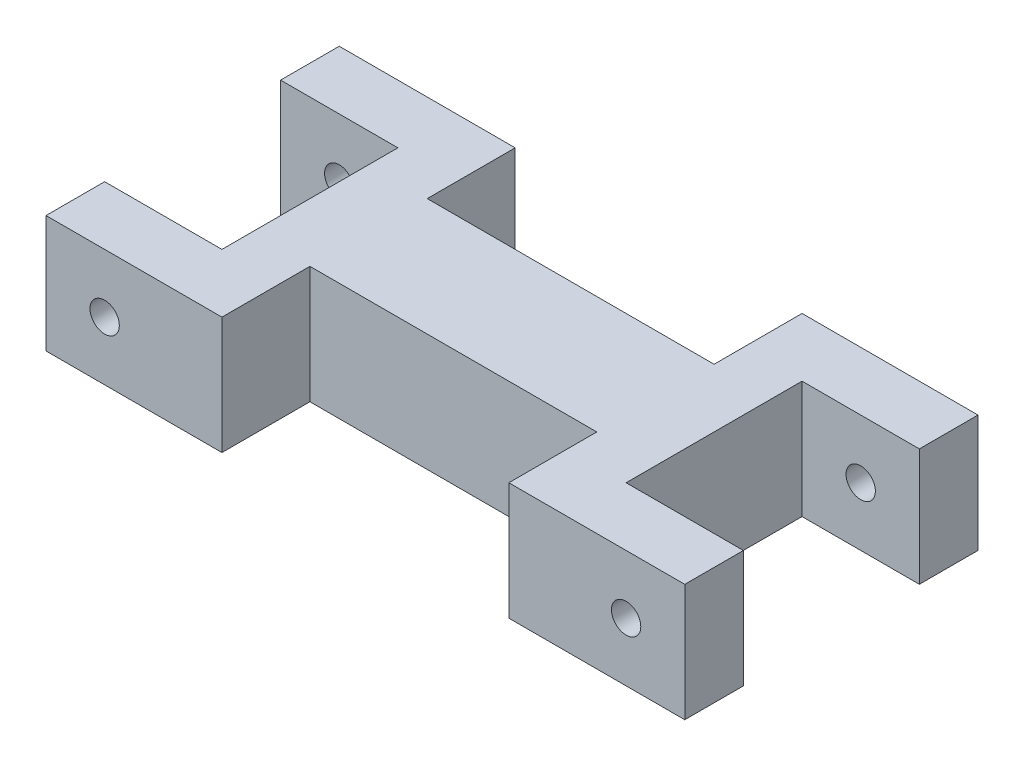
ISO-10303-21;
HEADER;
FILE_DESCRIPTION(('STEP AP214'),'2;1');
FILE_NAME('part.step','',(''),(''),'','','');
FILE_SCHEMA(('AUTOMOTIVE_DESIGN { 1 0 10303 214 1 1 1 1 }'));
ENDSEC;
DATA;
#1=APPLICATION_CONTEXT('core data for automotive mechanical design processes');
#2=APPLICATION_PROTOCOL_DEFINITION('international standard','automotive_design',2000,#1);
#3=PRODUCT_CONTEXT('',#1,'mechanical');
#4=PRODUCT('Part','Part','',(#3));
#5=PRODUCT_RELATED_PRODUCT_CATEGORY('part','',(#4));
#6=PRODUCT_DEFINITION_FORMATION('','',#4);
#7=PRODUCT_DEFINITION_CONTEXT('part definition',#1,'design');
#8=PRODUCT_DEFINITION('design','',#6,#7);
#9=PRODUCT_DEFINITION_SHAPE('','',#8);
#10=(LENGTH_UNIT() NAMED_UNIT(*) SI_UNIT(.MILLI.,.METRE.));
#11=(NAMED_UNIT(*) PLANE_ANGLE_UNIT() SI_UNIT($,.RADIAN.));
#12=(NAMED_UNIT(*) SI_UNIT($,.STERADIAN.) SOLID_ANGLE_UNIT());
#13=UNCERTAINTY_MEASURE_WITH_UNIT(LENGTH_MEASURE(1.E-05),#10,'distance_accuracy_value','');
#14=(GEOMETRIC_REPRESENTATION_CONTEXT(3) GLOBAL_UNCERTAINTY_ASSIGNED_CONTEXT((#13)) GLOBAL_UNIT_ASSIGNED_CONTEXT((#10,
#11,#12)) REPRESENTATION_CONTEXT('',''));
#15=CARTESIAN_POINT('',(0.,0.,0.));
#16=DIRECTION('',(0.,0.,1.));
#17=DIRECTION('',(1.,0.,0.));
#18=AXIS2_PLACEMENT_3D('',#15,#16,#17);
#19=CARTESIAN_POINT('',(0.,12.7,-9.525));
#20=DIRECTION('',(1.,0.,0.));
#21=DIRECTION('',(0.,0.,-1.));
#22=AXIS2_PLACEMENT_3D('',#19,#20,#21);
#23=PLANE('',#22);
#24=DIRECTION('',(0.,0.,1.));
#25=VECTOR('',#24,1.);
#26=CARTESIAN_POINT('',(0.,0.,-9.525));
#27=LINE('',#26,#25);
#28=CARTESIAN_POINT('',(0.,0.,-9.525));
#29=VERTEX_POINT('',#28);
#30=CARTESIAN_POINT('',(0.,0.,9.525));
#31=VERTEX_POINT('',#30);
#32=EDGE_CURVE('E201',#29,#31,#27,.T.);
#33=ORIENTED_EDGE('',*,*,#32,.T.);
#34=DIRECTION('',(0.,-1.,0.));
#35=VECTOR('',#34,1.);
#36=CARTESIAN_POINT('',(0.,12.7,9.525));
#37=LINE('',#36,#35);
#38=CARTESIAN_POINT('',(0.,12.7,9.525));
#39=VERTEX_POINT('',#38);
#40=EDGE_CURVE('E11',#39,#31,#37,.T.);
#41=ORIENTED_EDGE('',*,*,#40,.F.);
#42=DIRECTION('',(0.,0.,1.));
#43=VECTOR('',#42,1.);
#44=CARTESIAN_POINT('',(0.,12.7,-9.525));
#45=LINE('',#44,#43);
#46=CARTESIAN_POINT('',(0.,12.7,-9.525));
#47=VERTEX_POINT('',#46);
#48=EDGE_CURVE('E240',#47,#39,#45,.T.);
#49=ORIENTED_EDGE('',*,*,#48,.F.);
#50=DIRECTION('',(0.,-1.,0.));
#51=VECTOR('',#50,1.);
#52=CARTESIAN_POINT('',(0.,12.7,-9.525));
#53=LINE('',#52,#51);
#54=EDGE_CURVE('E197',#47,#29,#53,.T.);
#55=ORIENTED_EDGE('',*,*,#54,.T.);
#56=EDGE_LOOP('',(#33,#41,#49,#55));
#57=FACE_BOUND('',#56,.T.);
#58=ADVANCED_FACE('F32',(#57),#23,.F.);
#59=CARTESIAN_POINT('',(0.,12.7,9.525));
#60=DIRECTION('',(0.,0.,1.));
#61=DIRECTION('',(1.,0.,0.));
#62=AXIS2_PLACEMENT_3D('',#59,#60,#61);
#63=PLANE('',#62);
#64=CARTESIAN_POINT('',(-6.35,6.34999999999879,9.525));
#65=DIRECTION('',(0.,0.,1.));
#66=DIRECTION('',(1.,0.,0.));
#67=AXIS2_PLACEMENT_3D('',#64,#65,#66);
#68=CIRCLE('',#67,1.5875);
#69=CARTESIAN_POINT('',(-4.7625,6.34999999999879,9.525));
#70=VERTEX_POINT('',#69);
#71=EDGE_CURVE('E439',#70,#70,#68,.T.);
#72=ORIENTED_EDGE('',*,*,#71,.T.);
#73=EDGE_LOOP('',(#72));
#74=FACE_BOUND('',#73,.T.);
#75=DIRECTION('',(-1.,0.,0.));
#76=VECTOR('',#75,1.);
#77=CARTESIAN_POINT('',(0.,0.,9.525));
#78=LINE('',#77,#76);
#79=CARTESIAN_POINT('',(-12.7,0.,9.525));
#80=VERTEX_POINT('',#79);
#81=EDGE_CURVE('E204',#31,#80,#78,.T.);
#82=ORIENTED_EDGE('',*,*,#81,.T.);
#83=DIRECTION('',(0.,-1.,0.));
#84=VECTOR('',#83,1.);
#85=CARTESIAN_POINT('',(-12.7,12.7,9.525));
#86=LINE('',#85,#84);
#87=CARTESIAN_POINT('',(-12.7,12.7,9.525));
#88=VERTEX_POINT('',#87);
#89=EDGE_CURVE('E41',#88,#80,#86,.T.);
#90=ORIENTED_EDGE('',*,*,#89,.F.);
#91=DIRECTION('',(-1.,0.,0.));
#92=VECTOR('',#91,1.);
#93=CARTESIAN_POINT('',(0.,12.7,9.525));
#94=LINE('',#93,#92);
#95=EDGE_CURVE('E128',#39,#88,#94,.T.);
#96=ORIENTED_EDGE('',*,*,#95,.F.);
#97=ORIENTED_EDGE('',*,*,#40,.T.);
#98=EDGE_LOOP('',(#82,#90,#96,#97));
#99=FACE_BOUND('',#98,.T.);
#100=ADVANCED_FACE('F361',(#74,#99),#63,.F.);
#101=CARTESIAN_POINT('',(-12.7,12.7,9.525));
#102=DIRECTION('',(1.,0.,0.));
#103=DIRECTION('',(0.,0.,-1.));
#104=AXIS2_PLACEMENT_3D('',#101,#102,#103);
#105=PLANE('',#104);
#106=DIRECTION('',(0.,0.,1.));
#107=VECTOR('',#106,1.);
#108=CARTESIAN_POINT('',(-12.7,0.,9.525));
#109=LINE('',#108,#107);
#110=CARTESIAN_POINT('',(-12.7,0.,15.875));
#111=VERTEX_POINT('',#110);
#112=EDGE_CURVE('E207',#80,#111,#109,.T.);
#113=ORIENTED_EDGE('',*,*,#112,.T.);
#114=DIRECTION('',(0.,-1.,0.));
#115=VECTOR('',#114,1.);
#116=CARTESIAN_POINT('',(-12.7,12.7,15.875));
#117=LINE('',#116,#115);
#118=CARTESIAN_POINT('',(-12.7,12.7,15.875));
#119=VERTEX_POINT('',#118);
#120=EDGE_CURVE('E283',#119,#111,#117,.T.);
#121=ORIENTED_EDGE('',*,*,#120,.F.);
#122=DIRECTION('',(0.,0.,1.));
#123=VECTOR('',#122,1.);
#124=CARTESIAN_POINT('',(-12.7,12.7,9.525));
#125=LINE('',#124,#123);
#126=EDGE_CURVE('E292',#88,#119,#125,.T.);
#127=ORIENTED_EDGE('',*,*,#126,.F.);
#128=ORIENTED_EDGE('',*,*,#89,.T.);
#129=EDGE_LOOP('',(#113,#121,#127,#128));
#130=FACE_BOUND('',#129,.T.);
#131=ADVANCED_FACE('F290',(#130),#105,.F.);
#132=CARTESIAN_POINT('',(-12.7,12.7,15.875));
#133=DIRECTION('',(0.,0.,-1.));
#134=DIRECTION('',(-1.,0.,0.));
#135=AXIS2_PLACEMENT_3D('',#132,#133,#134);
#136=PLANE('',#135);
#137=CARTESIAN_POINT('',(-6.35,6.34999999999879,15.875));
#138=DIRECTION('',(0.,0.,1.));
#139=DIRECTION('',(1.,0.,0.));
#140=AXIS2_PLACEMENT_3D('',#137,#138,#139);
#141=CIRCLE('',#140,1.5875);
#142=CARTESIAN_POINT('',(-4.7625,6.34999999999879,15.875));
#143=VERTEX_POINT('',#142);
#144=EDGE_CURVE('E430',#143,#143,#141,.T.);
#145=ORIENTED_EDGE('',*,*,#144,.F.);
#146=EDGE_LOOP('',(#145));
#147=FACE_BOUND('',#146,.T.);
#148=DIRECTION('',(1.,0.,0.));
#149=VECTOR('',#148,1.);
#150=CARTESIAN_POINT('',(-12.7,0.,15.875));
#151=LINE('',#150,#149);
#152=CARTESIAN_POINT('',(6.35,0.,15.875));
#153=VERTEX_POINT('',#152);
#154=EDGE_CURVE('E209',#111,#153,#151,.T.);
#155=ORIENTED_EDGE('',*,*,#154,.T.);
#156=DIRECTION('',(0.,-1.,0.));
#157=VECTOR('',#156,1.);
#158=CARTESIAN_POINT('',(6.35,12.7,15.875));
#159=LINE('',#158,#157);
#160=CARTESIAN_POINT('',(6.35,12.7,15.875));
#161=VERTEX_POINT('',#160);
#162=EDGE_CURVE('E280',#161,#153,#159,.T.);
#163=ORIENTED_EDGE('',*,*,#162,.F.);
#164=DIRECTION('',(1.,0.,0.));
#165=VECTOR('',#164,1.);
#166=CARTESIAN_POINT('',(-12.7,12.7,15.875));
#167=LINE('',#166,#165);
#168=EDGE_CURVE('E310',#119,#161,#167,.T.);
#169=ORIENTED_EDGE('',*,*,#168,.F.);
#170=ORIENTED_EDGE('',*,*,#120,.T.);
#171=EDGE_LOOP('',(#155,#163,#169,#170));
#172=FACE_BOUND('',#171,.T.);
#173=ADVANCED_FACE('F301',(#147,#172),#136,.F.);
#174=CARTESIAN_POINT('',(6.35,12.7,15.875));
#175=DIRECTION('',(-1.,0.,0.));
#176=DIRECTION('',(0.,0.,1.));
#177=AXIS2_PLACEMENT_3D('',#174,#175,#176);
#178=PLANE('',#177);
#179=DIRECTION('',(0.,0.,-1.));
#180=VECTOR('',#179,1.);
#181=CARTESIAN_POINT('',(6.35,0.,15.875));
#182=LINE('',#181,#180);
#183=CARTESIAN_POINT('',(6.34999999999999,0.,6.35));
#184=VERTEX_POINT('',#183);
#185=EDGE_CURVE('E211',#153,#184,#182,.T.);
#186=ORIENTED_EDGE('',*,*,#185,.T.);
#187=DIRECTION('',(0.,-1.,0.));
#188=VECTOR('',#187,1.);
#189=CARTESIAN_POINT('',(6.34999999999999,12.7,6.35));
#190=LINE('',#189,#188);
#191=CARTESIAN_POINT('',(6.34999999999999,12.7,6.35));
#192=VERTEX_POINT('',#191);
#193=EDGE_CURVE('E277',#192,#184,#190,.T.);
#194=ORIENTED_EDGE('',*,*,#193,.F.);
#195=DIRECTION('',(0.,0.,-1.));
#196=VECTOR('',#195,1.);
#197=CARTESIAN_POINT('',(6.35,12.7,15.875));
#198=LINE('',#197,#196);
#199=EDGE_CURVE('E307',#161,#192,#198,.T.);
#200=ORIENTED_EDGE('',*,*,#199,.F.);
#201=ORIENTED_EDGE('',*,*,#162,.T.);
#202=EDGE_LOOP('',(#186,#194,#200,#201));
#203=FACE_BOUND('',#202,.T.);
#204=ADVANCED_FACE('F305',(#203),#178,.F.);
#205=CARTESIAN_POINT('',(6.34999999999999,12.7,6.35));
#206=DIRECTION('',(0.,0.,-1.));
#207=DIRECTION('',(-1.,0.,0.));
#208=AXIS2_PLACEMENT_3D('',#205,#206,#207);
#209=PLANE('',#208);
#210=DIRECTION('',(1.,0.,0.));
#211=VECTOR('',#210,1.);
#212=CARTESIAN_POINT('',(6.34999999999999,0.,6.35));
#213=LINE('',#212,#211);
#214=CARTESIAN_POINT('',(37.410945752,0.,6.35));
#215=VERTEX_POINT('',#214);
#216=EDGE_CURVE('E213',#184,#215,#213,.T.);
#217=ORIENTED_EDGE('',*,*,#216,.T.);
#218=DIRECTION('',(0.,-1.,0.));
#219=VECTOR('',#218,1.);
#220=CARTESIAN_POINT('',(37.410945752,12.7,6.35));
#221=LINE('',#220,#219);
#222=CARTESIAN_POINT('',(37.410945752,12.7,6.35));
#223=VERTEX_POINT('',#222);
#224=EDGE_CURVE('E274',#223,#215,#221,.T.);
#225=ORIENTED_EDGE('',*,*,#224,.F.);
#226=DIRECTION('',(1.,0.,0.));
#227=VECTOR('',#226,1.);
#228=CARTESIAN_POINT('',(6.34999999999999,12.7,6.35));
#229=LINE('',#228,#227);
#230=EDGE_CURVE('E309',#192,#223,#229,.T.);
#231=ORIENTED_EDGE('',*,*,#230,.F.);
#232=ORIENTED_EDGE('',*,*,#193,.T.);
#233=EDGE_LOOP('',(#217,#225,#231,#232));
#234=FACE_BOUND('',#233,.T.);
#235=ADVANCED_FACE('F377',(#234),#209,.F.);
#236=CARTESIAN_POINT('',(37.410945752,12.7,6.35));
#237=DIRECTION('',(1.,0.,0.));
#238=DIRECTION('',(0.,0.,-1.));
#239=AXIS2_PLACEMENT_3D('',#236,#237,#238);
#240=PLANE('',#239);
#241=DIRECTION('',(0.,0.,1.));
#242=VECTOR('',#241,1.);
#243=CARTESIAN_POINT('',(37.410945752,0.,6.35));
#244=LINE('',#243,#242);
#245=CARTESIAN_POINT('',(37.410945752,0.,15.875));
#246=VERTEX_POINT('',#245);
#247=EDGE_CURVE('E215',#215,#246,#244,.T.);
#248=ORIENTED_EDGE('',*,*,#247,.T.);
#249=DIRECTION('',(0.,-1.,0.));
#250=VECTOR('',#249,1.);
#251=CARTESIAN_POINT('',(37.410945752,12.7,15.875));
#252=LINE('',#251,#250);
#253=CARTESIAN_POINT('',(37.410945752,12.7,15.875));
#254=VERTEX_POINT('',#253);
#255=EDGE_CURVE('E271',#254,#246,#252,.T.);
#256=ORIENTED_EDGE('',*,*,#255,.F.);
#257=DIRECTION('',(0.,0.,1.));
#258=VECTOR('',#257,1.);
#259=CARTESIAN_POINT('',(37.410945752,12.7,6.35));
#260=LINE('',#259,#258);
#261=EDGE_CURVE('E312',#223,#254,#260,.T.);
#262=ORIENTED_EDGE('',*,*,#261,.F.);
#263=ORIENTED_EDGE('',*,*,#224,.T.);
#264=EDGE_LOOP('',(#248,#256,#262,#263));
#265=FACE_BOUND('',#264,.T.);
#266=ADVANCED_FACE('F380',(#265),#240,.F.);
#267=CARTESIAN_POINT('',(37.410945752,12.7,15.875));
#268=DIRECTION('',(0.,0.,-1.));
#269=DIRECTION('',(-1.,0.,0.));
#270=AXIS2_PLACEMENT_3D('',#267,#268,#269);
#271=PLANE('',#270);
#272=CARTESIAN_POINT('',(50.110945752,6.35,15.875));
#273=DIRECTION('',(0.,0.,1.));
#274=DIRECTION('',(1.,0.,0.));
#275=AXIS2_PLACEMENT_3D('',#272,#273,#274);
#276=CIRCLE('',#275,1.58749999999998);
#277=CARTESIAN_POINT('',(51.698445752,6.35,15.875));
#278=VERTEX_POINT('',#277);
#279=EDGE_CURVE('E429',#278,#278,#276,.T.);
#280=ORIENTED_EDGE('',*,*,#279,.F.);
#281=EDGE_LOOP('',(#280));
#282=FACE_BOUND('',#281,.T.);
#283=DIRECTION('',(1.,0.,0.));
#284=VECTOR('',#283,1.);
#285=CARTESIAN_POINT('',(37.410945752,0.,15.875));
#286=LINE('',#285,#284);
#287=CARTESIAN_POINT('',(56.460945752,0.,15.875));
#288=VERTEX_POINT('',#287);
#289=EDGE_CURVE('E217',#246,#288,#286,.T.);
#290=ORIENTED_EDGE('',*,*,#289,.T.);
#291=DIRECTION('',(0.,-1.,0.));
#292=VECTOR('',#291,1.);
#293=CARTESIAN_POINT('',(56.460945752,12.7,15.875));
#294=LINE('',#293,#292);
#295=CARTESIAN_POINT('',(56.460945752,12.7,15.875));
#296=VERTEX_POINT('',#295);
#297=EDGE_CURVE('E268',#296,#288,#294,.T.);
#298=ORIENTED_EDGE('',*,*,#297,.F.);
#299=DIRECTION('',(1.,0.,0.));
#300=VECTOR('',#299,1.);
#301=CARTESIAN_POINT('',(37.410945752,12.7,15.875));
#302=LINE('',#301,#300);
#303=EDGE_CURVE('E318',#254,#296,#302,.T.);
#304=ORIENTED_EDGE('',*,*,#303,.F.);
#305=ORIENTED_EDGE('',*,*,#255,.T.);
#306=EDGE_LOOP('',(#290,#298,#304,#305));
#307=FACE_BOUND('',#306,.T.);
#308=ADVANCED_FACE('F384',(#282,#307),#271,.F.);
#309=CARTESIAN_POINT('',(56.460945752,12.7,15.875));
#310=DIRECTION('',(-1.,0.,0.));
#311=DIRECTION('',(0.,0.,1.));
#312=AXIS2_PLACEMENT_3D('',#309,#310,#311);
#313=PLANE('',#312);
#314=DIRECTION('',(0.,0.,-1.));
#315=VECTOR('',#314,1.);
#316=CARTESIAN_POINT('',(56.460945752,0.,15.875));
#317=LINE('',#316,#315);
#318=CARTESIAN_POINT('',(56.460945752,0.,9.525));
#319=VERTEX_POINT('',#318);
#320=EDGE_CURVE('E219',#288,#319,#317,.T.);
#321=ORIENTED_EDGE('',*,*,#320,.T.);
#322=DIRECTION('',(0.,-1.,0.));
#323=VECTOR('',#322,1.);
#324=CARTESIAN_POINT('',(56.460945752,12.7,9.525));
#325=LINE('',#324,#323);
#326=CARTESIAN_POINT('',(56.460945752,12.7,9.525));
#327=VERTEX_POINT('',#326);
#328=EDGE_CURVE('E265',#327,#319,#325,.T.);
#329=ORIENTED_EDGE('',*,*,#328,.F.);
#330=DIRECTION('',(0.,0.,-1.));
#331=VECTOR('',#330,1.);
#332=CARTESIAN_POINT('',(56.460945752,12.7,15.875));
#333=LINE('',#332,#331);
#334=EDGE_CURVE('E320',#296,#327,#333,.T.);
#335=ORIENTED_EDGE('',*,*,#334,.F.);
#336=ORIENTED_EDGE('',*,*,#297,.T.);
#337=EDGE_LOOP('',(#321,#329,#335,#336));
#338=FACE_BOUND('',#337,.T.);
#339=ADVANCED_FACE('F388',(#338),#313,.F.);
#340=CARTESIAN_POINT('',(56.460945752,12.7,9.525));
#341=DIRECTION('',(0.,0.,1.));
#342=DIRECTION('',(1.,0.,0.));
#343=AXIS2_PLACEMENT_3D('',#340,#341,#342);
#344=PLANE('',#343);
#345=CARTESIAN_POINT('',(50.110945752,6.35,9.525));
#346=DIRECTION('',(0.,0.,1.));
#347=DIRECTION('',(1.,0.,0.));
#348=AXIS2_PLACEMENT_3D('',#345,#346,#347);
#349=CIRCLE('',#348,1.58749999999998);
#350=CARTESIAN_POINT('',(51.698445752,6.35,9.525));
#351=VERTEX_POINT('',#350);
#352=EDGE_CURVE('E205',#351,#351,#349,.T.);
#353=ORIENTED_EDGE('',*,*,#352,.T.);
#354=EDGE_LOOP('',(#353));
#355=FACE_BOUND('',#354,.T.);
#356=DIRECTION('',(-1.,0.,0.));
#357=VECTOR('',#356,1.);
#358=CARTESIAN_POINT('',(56.460945752,0.,9.525));
#359=LINE('',#358,#357);
#360=CARTESIAN_POINT('',(43.760945752,0.,9.525));
#361=VERTEX_POINT('',#360);
#362=EDGE_CURVE('E221',#319,#361,#359,.T.);
#363=ORIENTED_EDGE('',*,*,#362,.T.);
#364=DIRECTION('',(0.,-1.,0.));
#365=VECTOR('',#364,1.);
#366=CARTESIAN_POINT('',(43.760945752,12.7,9.525));
#367=LINE('',#366,#365);
#368=CARTESIAN_POINT('',(43.760945752,12.7,9.525));
#369=VERTEX_POINT('',#368);
#370=EDGE_CURVE('E262',#369,#361,#367,.T.);
#371=ORIENTED_EDGE('',*,*,#370,.F.);
#372=DIRECTION('',(-1.,0.,0.));
#373=VECTOR('',#372,1.);
#374=CARTESIAN_POINT('',(56.460945752,12.7,9.525));
#375=LINE('',#374,#373);
#376=EDGE_CURVE('E322',#327,#369,#375,.T.);
#377=ORIENTED_EDGE('',*,*,#376,.F.);
#378=ORIENTED_EDGE('',*,*,#328,.T.);
#379=EDGE_LOOP('',(#363,#371,#377,#378));
#380=FACE_BOUND('',#379,.T.);
#381=ADVANCED_FACE('F392',(#355,#380),#344,.F.);
#382=CARTESIAN_POINT('',(43.760945752,12.7,-9.525));
#383=DIRECTION('',(-1.,0.,0.));
#384=DIRECTION('',(0.,0.,1.));
#385=AXIS2_PLACEMENT_3D('',#382,#383,#384);
#386=PLANE('',#385);
#387=DIRECTION('',(0.,0.,-1.));
#388=VECTOR('',#387,1.);
#389=CARTESIAN_POINT('',(43.760945752,0.,-9.525));
#390=LINE('',#389,#388);
#391=CARTESIAN_POINT('',(43.760945752,0.,-9.525));
#392=VERTEX_POINT('',#391);
#393=EDGE_CURVE('E223',#361,#392,#390,.T.);
#394=ORIENTED_EDGE('',*,*,#393,.T.);
#395=DIRECTION('',(0.,-1.,0.));
#396=VECTOR('',#395,1.);
#397=CARTESIAN_POINT('',(43.760945752,12.7,-9.525));
#398=LINE('',#397,#396);
#399=CARTESIAN_POINT('',(43.760945752,12.7,-9.525));
#400=VERTEX_POINT('',#399);
#401=EDGE_CURVE('E259',#400,#392,#398,.T.);
#402=ORIENTED_EDGE('',*,*,#401,.F.);
#403=DIRECTION('',(0.,0.,-1.));
#404=VECTOR('',#403,1.);
#405=CARTESIAN_POINT('',(43.760945752,12.7,-9.525));
#406=LINE('',#405,#404);
#407=EDGE_CURVE('E324',#369,#400,#406,.T.);
#408=ORIENTED_EDGE('',*,*,#407,.F.);
#409=ORIENTED_EDGE('',*,*,#370,.T.);
#410=EDGE_LOOP('',(#394,#402,#408,#409));
#411=FACE_BOUND('',#410,.T.);
#412=ADVANCED_FACE('F396',(#411),#386,.F.);
#413=CARTESIAN_POINT('',(56.460945752,12.7,-9.525));
#414=DIRECTION('',(0.,0.,-1.));
#415=DIRECTION('',(-1.,0.,0.));
#416=AXIS2_PLACEMENT_3D('',#413,#414,#415);
#417=PLANE('',#416);
#418=CARTESIAN_POINT('',(50.110945752,6.35,-9.525));
#419=DIRECTION('',(0.,0.,-1.));
#420=DIRECTION('',(-1.,0.,0.));
#421=AXIS2_PLACEMENT_3D('',#418,#419,#420);
#422=CIRCLE('',#421,1.58749999999998);
#423=CARTESIAN_POINT('',(48.523445752,6.35,-9.525));
#424=VERTEX_POINT('',#423);
#425=EDGE_CURVE('E441',#424,#424,#422,.T.);
#426=ORIENTED_EDGE('',*,*,#425,.T.);
#427=EDGE_LOOP('',(#426));
#428=FACE_BOUND('',#427,.T.);
#429=DIRECTION('',(1.,0.,0.));
#430=VECTOR('',#429,1.);
#431=CARTESIAN_POINT('',(56.460945752,0.,-9.525));
#432=LINE('',#431,#430);
#433=CARTESIAN_POINT('',(56.460945752,0.,-9.525));
#434=VERTEX_POINT('',#433);
#435=EDGE_CURVE('E225',#392,#434,#432,.T.);
#436=ORIENTED_EDGE('',*,*,#435,.T.);
#437=DIRECTION('',(0.,-1.,0.));
#438=VECTOR('',#437,1.);
#439=CARTESIAN_POINT('',(56.460945752,12.7,-9.525));
#440=LINE('',#439,#438);
#441=CARTESIAN_POINT('',(56.460945752,12.7,-9.525));
#442=VERTEX_POINT('',#441);
#443=EDGE_CURVE('E256',#442,#434,#440,.T.);
#444=ORIENTED_EDGE('',*,*,#443,.F.);
#445=DIRECTION('',(1.,0.,0.));
#446=VECTOR('',#445,1.);
#447=CARTESIAN_POINT('',(56.460945752,12.7,-9.525));
#448=LINE('',#447,#446);
#449=EDGE_CURVE('E326',#400,#442,#448,.T.);
#450=ORIENTED_EDGE('',*,*,#449,.F.);
#451=ORIENTED_EDGE('',*,*,#401,.T.);
#452=EDGE_LOOP('',(#436,#444,#450,#451));
#453=FACE_BOUND('',#452,.T.);
#454=ADVANCED_FACE('F400',(#428,#453),#417,.F.);
#455=CARTESIAN_POINT('',(56.460945752,12.7,-15.875));
#456=DIRECTION('',(-1.,0.,0.));
#457=DIRECTION('',(0.,0.,1.));
#458=AXIS2_PLACEMENT_3D('',#455,#456,#457);
#459=PLANE('',#458);
#460=DIRECTION('',(0.,0.,-1.));
#461=VECTOR('',#460,1.);
#462=CARTESIAN_POINT('',(56.460945752,0.,-15.875));
#463=LINE('',#462,#461);
#464=CARTESIAN_POINT('',(56.460945752,0.,-15.875));
#465=VERTEX_POINT('',#464);
#466=EDGE_CURVE('E227',#434,#465,#463,.T.);
#467=ORIENTED_EDGE('',*,*,#466,.T.);
#468=DIRECTION('',(0.,-1.,0.));
#469=VECTOR('',#468,1.);
#470=CARTESIAN_POINT('',(56.460945752,12.7,-15.875));
#471=LINE('',#470,#469);
#472=CARTESIAN_POINT('',(56.460945752,12.7,-15.875));
#473=VERTEX_POINT('',#472);
#474=EDGE_CURVE('E253',#473,#465,#471,.T.);
#475=ORIENTED_EDGE('',*,*,#474,.F.);
#476=DIRECTION('',(0.,0.,-1.));
#477=VECTOR('',#476,1.);
#478=CARTESIAN_POINT('',(56.460945752,12.7,-15.875));
#479=LINE('',#478,#477);
#480=EDGE_CURVE('E328',#442,#473,#479,.T.);
#481=ORIENTED_EDGE('',*,*,#480,.F.);
#482=ORIENTED_EDGE('',*,*,#443,.T.);
#483=EDGE_LOOP('',(#467,#475,#481,#482));
#484=FACE_BOUND('',#483,.T.);
#485=ADVANCED_FACE('F404',(#484),#459,.F.);
#486=CARTESIAN_POINT('',(37.410945752,12.7,-15.875));
#487=DIRECTION('',(0.,0.,1.));
#488=DIRECTION('',(1.,0.,0.));
#489=AXIS2_PLACEMENT_3D('',#486,#487,#488);
#490=PLANE('',#489);
#491=CARTESIAN_POINT('',(50.110945752,6.35,-15.875));
#492=DIRECTION('',(0.,0.,1.));
#493=DIRECTION('',(1.,0.,0.));
#494=AXIS2_PLACEMENT_3D('',#491,#492,#493);
#495=CIRCLE('',#494,1.58749999999998);
#496=CARTESIAN_POINT('',(51.698445752,6.35,-15.875));
#497=VERTEX_POINT('',#496);
#498=EDGE_CURVE('E433',#497,#497,#495,.T.);
#499=ORIENTED_EDGE('',*,*,#498,.T.);
#500=EDGE_LOOP('',(#499));
#501=FACE_BOUND('',#500,.T.);
#502=DIRECTION('',(-1.,0.,0.));
#503=VECTOR('',#502,1.);
#504=CARTESIAN_POINT('',(37.410945752,0.,-15.875));
#505=LINE('',#504,#503);
#506=CARTESIAN_POINT('',(37.410945752,0.,-15.875));
#507=VERTEX_POINT('',#506);
#508=EDGE_CURVE('E229',#465,#507,#505,.T.);
#509=ORIENTED_EDGE('',*,*,#508,.T.);
#510=DIRECTION('',(0.,-1.,0.));
#511=VECTOR('',#510,1.);
#512=CARTESIAN_POINT('',(37.410945752,12.7,-15.875));
#513=LINE('',#512,#511);
#514=CARTESIAN_POINT('',(37.410945752,12.7,-15.875));
#515=VERTEX_POINT('',#514);
#516=EDGE_CURVE('E250',#515,#507,#513,.T.);
#517=ORIENTED_EDGE('',*,*,#516,.F.);
#518=DIRECTION('',(-1.,0.,0.));
#519=VECTOR('',#518,1.);
#520=CARTESIAN_POINT('',(37.410945752,12.7,-15.875));
#521=LINE('',#520,#519);
#522=EDGE_CURVE('E330',#473,#515,#521,.T.);
#523=ORIENTED_EDGE('',*,*,#522,.F.);
#524=ORIENTED_EDGE('',*,*,#474,.T.);
#525=EDGE_LOOP('',(#509,#517,#523,#524));
#526=FACE_BOUND('',#525,.T.);
#527=ADVANCED_FACE('F408',(#501,#526),#490,.F.);
#528=CARTESIAN_POINT('',(37.410945752,12.7,-6.35));
#529=DIRECTION('',(1.,0.,0.));
#530=DIRECTION('',(0.,0.,-1.));
#531=AXIS2_PLACEMENT_3D('',#528,#529,#530);
#532=PLANE('',#531);
#533=DIRECTION('',(0.,0.,1.));
#534=VECTOR('',#533,1.);
#535=CARTESIAN_POINT('',(37.410945752,0.,-6.35));
#536=LINE('',#535,#534);
#537=CARTESIAN_POINT('',(37.410945752,0.,-6.35));
#538=VERTEX_POINT('',#537);
#539=EDGE_CURVE('E231',#507,#538,#536,.T.);
#540=ORIENTED_EDGE('',*,*,#539,.T.);
#541=DIRECTION('',(0.,-1.,0.));
#542=VECTOR('',#541,1.);
#543=CARTESIAN_POINT('',(37.410945752,12.7,-6.35));
#544=LINE('',#543,#542);
#545=CARTESIAN_POINT('',(37.410945752,12.7,-6.35));
#546=VERTEX_POINT('',#545);
#547=EDGE_CURVE('E247',#546,#538,#544,.T.);
#548=ORIENTED_EDGE('',*,*,#547,.F.);
#549=DIRECTION('',(0.,0.,1.));
#550=VECTOR('',#549,1.);
#551=CARTESIAN_POINT('',(37.410945752,12.7,-6.35));
#552=LINE('',#551,#550);
#553=EDGE_CURVE('E332',#515,#546,#552,.T.);
#554=ORIENTED_EDGE('',*,*,#553,.F.);
#555=ORIENTED_EDGE('',*,*,#516,.T.);
#556=EDGE_LOOP('',(#540,#548,#554,#555));
#557=FACE_BOUND('',#556,.T.);
#558=ADVANCED_FACE('F412',(#557),#532,.F.);
#559=CARTESIAN_POINT('',(6.34999999999999,12.7,-6.35));
#560=DIRECTION('',(0.,0.,1.));
#561=DIRECTION('',(1.,0.,0.));
#562=AXIS2_PLACEMENT_3D('',#559,#560,#561);
#563=PLANE('',#562);
#564=DIRECTION('',(-1.,0.,0.));
#565=VECTOR('',#564,1.);
#566=CARTESIAN_POINT('',(6.34999999999999,0.,-6.35));
#567=LINE('',#566,#565);
#568=CARTESIAN_POINT('',(6.34999999999999,0.,-6.35));
#569=VERTEX_POINT('',#568);
#570=EDGE_CURVE('E233',#538,#569,#567,.T.);
#571=ORIENTED_EDGE('',*,*,#570,.T.);
#572=DIRECTION('',(0.,-1.,0.));
#573=VECTOR('',#572,1.);
#574=CARTESIAN_POINT('',(6.34999999999999,12.7,-6.35));
#575=LINE('',#574,#573);
#576=CARTESIAN_POINT('',(6.34999999999999,12.7,-6.35));
#577=VERTEX_POINT('',#576);
#578=EDGE_CURVE('E244',#577,#569,#575,.T.);
#579=ORIENTED_EDGE('',*,*,#578,.F.);
#580=DIRECTION('',(-1.,0.,0.));
#581=VECTOR('',#580,1.);
#582=CARTESIAN_POINT('',(6.34999999999999,12.7,-6.35));
#583=LINE('',#582,#581);
#584=EDGE_CURVE('E334',#546,#577,#583,.T.);
#585=ORIENTED_EDGE('',*,*,#584,.F.);
#586=ORIENTED_EDGE('',*,*,#547,.T.);
#587=EDGE_LOOP('',(#571,#579,#585,#586));
#588=FACE_BOUND('',#587,.T.);
#589=ADVANCED_FACE('F340',(#588),#563,.F.);
#590=CARTESIAN_POINT('',(6.35,12.7,-15.875));
#591=DIRECTION('',(-1.,0.,0.));
#592=DIRECTION('',(0.,0.,1.));
#593=AXIS2_PLACEMENT_3D('',#590,#591,#592);
#594=PLANE('',#593);
#595=DIRECTION('',(0.,0.,-1.));
#596=VECTOR('',#595,1.);
#597=CARTESIAN_POINT('',(6.35,0.,-15.875));
#598=LINE('',#597,#596);
#599=CARTESIAN_POINT('',(6.35,0.,-15.875));
#600=VERTEX_POINT('',#599);
#601=EDGE_CURVE('E235',#569,#600,#598,.T.);
#602=ORIENTED_EDGE('',*,*,#601,.T.);
#603=DIRECTION('',(0.,-1.,0.));
#604=VECTOR('',#603,1.);
#605=CARTESIAN_POINT('',(6.35,12.7,-15.875));
#606=LINE('',#605,#604);
#607=CARTESIAN_POINT('',(6.35,12.7,-15.875));
#608=VERTEX_POINT('',#607);
#609=EDGE_CURVE('E192',#608,#600,#606,.T.);
#610=ORIENTED_EDGE('',*,*,#609,.F.);
#611=DIRECTION('',(0.,0.,-1.));
#612=VECTOR('',#611,1.);
#613=CARTESIAN_POINT('',(6.35,12.7,-15.875));
#614=LINE('',#613,#612);
#615=EDGE_CURVE('E183',#577,#608,#614,.T.);
#616=ORIENTED_EDGE('',*,*,#615,.F.);
#617=ORIENTED_EDGE('',*,*,#578,.T.);
#618=EDGE_LOOP('',(#602,#610,#616,#617));
#619=FACE_BOUND('',#618,.T.);
#620=ADVANCED_FACE('F344',(#619),#594,.F.);
#621=CARTESIAN_POINT('',(-12.7,12.7,-15.875));
#622=DIRECTION('',(0.,0.,1.));
#623=DIRECTION('',(1.,0.,0.));
#624=AXIS2_PLACEMENT_3D('',#621,#622,#623);
#625=PLANE('',#624);
#626=CARTESIAN_POINT('',(-6.35,6.34999999999879,-15.875));
#627=DIRECTION('',(0.,0.,1.));
#628=DIRECTION('',(1.,0.,0.));
#629=AXIS2_PLACEMENT_3D('',#626,#627,#628);
#630=CIRCLE('',#629,1.5875);
#631=CARTESIAN_POINT('',(-4.7625,6.34999999999879,-15.875));
#632=VERTEX_POINT('',#631);
#633=EDGE_CURVE('E427',#632,#632,#630,.T.);
#634=ORIENTED_EDGE('',*,*,#633,.T.);
#635=EDGE_LOOP('',(#634));
#636=FACE_BOUND('',#635,.T.);
#637=DIRECTION('',(-1.,0.,0.));
#638=VECTOR('',#637,1.);
#639=CARTESIAN_POINT('',(-12.7,0.,-15.875));
#640=LINE('',#639,#638);
#641=CARTESIAN_POINT('',(-12.7,0.,-15.875));
#642=VERTEX_POINT('',#641);
#643=EDGE_CURVE('E191',#600,#642,#640,.T.);
#644=ORIENTED_EDGE('',*,*,#643,.T.);
#645=DIRECTION('',(0.,-1.,0.));
#646=VECTOR('',#645,1.);
#647=CARTESIAN_POINT('',(-12.7,12.7,-15.875));
#648=LINE('',#647,#646);
#649=CARTESIAN_POINT('',(-12.7,12.7,-15.875));
#650=VERTEX_POINT('',#649);
#651=EDGE_CURVE('E188',#650,#642,#648,.T.);
#652=ORIENTED_EDGE('',*,*,#651,.F.);
#653=DIRECTION('',(-1.,0.,0.));
#654=VECTOR('',#653,1.);
#655=CARTESIAN_POINT('',(-12.7,12.7,-15.875));
#656=LINE('',#655,#654);
#657=EDGE_CURVE('E177',#608,#650,#656,.T.);
#658=ORIENTED_EDGE('',*,*,#657,.F.);
#659=ORIENTED_EDGE('',*,*,#609,.T.);
#660=EDGE_LOOP('',(#644,#652,#658,#659));
#661=FACE_BOUND('',#660,.T.);
#662=ADVANCED_FACE('F189',(#636,#661),#625,.F.);
#663=CARTESIAN_POINT('',(-12.7,12.7,-9.525));
#664=DIRECTION('',(1.,0.,0.));
#665=DIRECTION('',(0.,0.,-1.));
#666=AXIS2_PLACEMENT_3D('',#663,#664,#665);
#667=PLANE('',#666);
#668=DIRECTION('',(0.,0.,1.));
#669=VECTOR('',#668,1.);
#670=CARTESIAN_POINT('',(-12.7,0.,-9.525));
#671=LINE('',#670,#669);
#672=CARTESIAN_POINT('',(-12.7,0.,-9.525));
#673=VERTEX_POINT('',#672);
#674=EDGE_CURVE('E114',#642,#673,#671,.T.);
#675=ORIENTED_EDGE('',*,*,#674,.T.);
#676=DIRECTION('',(0.,-1.,0.));
#677=VECTOR('',#676,1.);
#678=CARTESIAN_POINT('',(-12.7,12.7,-9.525));
#679=LINE('',#678,#677);
#680=CARTESIAN_POINT('',(-12.7,12.7,-9.525));
#681=VERTEX_POINT('',#680);
#682=EDGE_CURVE('E193',#681,#673,#679,.T.);
#683=ORIENTED_EDGE('',*,*,#682,.F.);
#684=DIRECTION('',(0.,0.,1.));
#685=VECTOR('',#684,1.);
#686=CARTESIAN_POINT('',(-12.7,12.7,-9.525));
#687=LINE('',#686,#685);
#688=EDGE_CURVE('E181',#650,#681,#687,.T.);
#689=ORIENTED_EDGE('',*,*,#688,.F.);
#690=ORIENTED_EDGE('',*,*,#651,.T.);
#691=EDGE_LOOP('',(#675,#683,#689,#690));
#692=FACE_BOUND('',#691,.T.);
#693=ADVANCED_FACE('F195',(#692),#667,.F.);
#694=CARTESIAN_POINT('',(0.,12.7,-9.525));
#695=DIRECTION('',(0.,0.,-1.));
#696=DIRECTION('',(-1.,0.,0.));
#697=AXIS2_PLACEMENT_3D('',#694,#695,#696);
#698=PLANE('',#697);
#699=CARTESIAN_POINT('',(-6.35,6.34999999999879,-9.525));
#700=DIRECTION('',(0.,0.,-1.));
#701=DIRECTION('',(-1.,0.,0.));
#702=AXIS2_PLACEMENT_3D('',#699,#700,#701);
#703=CIRCLE('',#702,1.5875);
#704=CARTESIAN_POINT('',(-7.9375,6.34999999999879,-9.525));
#705=VERTEX_POINT('',#704);
#706=EDGE_CURVE('E35',#705,#705,#703,.T.);
#707=ORIENTED_EDGE('',*,*,#706,.T.);
#708=EDGE_LOOP('',(#707));
#709=FACE_BOUND('',#708,.T.);
#710=DIRECTION('',(1.,0.,0.));
#711=VECTOR('',#710,1.);
#712=CARTESIAN_POINT('',(0.,0.,-9.525));
#713=LINE('',#712,#711);
#714=EDGE_CURVE('E120',#673,#29,#713,.T.);
#715=ORIENTED_EDGE('',*,*,#714,.T.);
#716=ORIENTED_EDGE('',*,*,#54,.F.);
#717=DIRECTION('',(1.,0.,0.));
#718=VECTOR('',#717,1.);
#719=CARTESIAN_POINT('',(0.,12.7,-9.525));
#720=LINE('',#719,#718);
#721=EDGE_CURVE('E49',#681,#47,#720,.T.);
#722=ORIENTED_EDGE('',*,*,#721,.F.);
#723=ORIENTED_EDGE('',*,*,#682,.T.);
#724=EDGE_LOOP('',(#715,#716,#722,#723));
#725=FACE_BOUND('',#724,.T.);
#726=ADVANCED_FACE('F348',(#709,#725),#698,.F.);
#727=CARTESIAN_POINT('',(0.,12.7,0.));
#728=DIRECTION('',(0.,-1.,0.));
#729=DIRECTION('',(0.,0.,-1.));
#730=AXIS2_PLACEMENT_3D('',#727,#728,#729);
#731=PLANE('',#730);
#732=ORIENTED_EDGE('',*,*,#48,.T.);
#733=ORIENTED_EDGE('',*,*,#95,.T.);
#734=ORIENTED_EDGE('',*,*,#126,.T.);
#735=ORIENTED_EDGE('',*,*,#168,.T.);
#736=ORIENTED_EDGE('',*,*,#199,.T.);
#737=ORIENTED_EDGE('',*,*,#230,.T.);
#738=ORIENTED_EDGE('',*,*,#261,.T.);
#739=ORIENTED_EDGE('',*,*,#303,.T.);
#740=ORIENTED_EDGE('',*,*,#334,.T.);
#741=ORIENTED_EDGE('',*,*,#376,.T.);
#742=ORIENTED_EDGE('',*,*,#407,.T.);
#743=ORIENTED_EDGE('',*,*,#449,.T.);
#744=ORIENTED_EDGE('',*,*,#480,.T.);
#745=ORIENTED_EDGE('',*,*,#522,.T.);
#746=ORIENTED_EDGE('',*,*,#553,.T.);
#747=ORIENTED_EDGE('',*,*,#584,.T.);
#748=ORIENTED_EDGE('',*,*,#615,.T.);
#749=ORIENTED_EDGE('',*,*,#657,.T.);
#750=ORIENTED_EDGE('',*,*,#688,.T.);
#751=ORIENTED_EDGE('',*,*,#721,.T.);
#752=EDGE_LOOP('',(#732,#733,#734,#735,#736,#737,#738,#739,#740,#741,#742,#743,#744,#745,#746,
#747,#748,#749,#750,#751));
#753=FACE_BOUND('',#752,.T.);
#754=ADVANCED_FACE('F179',(#753),#731,.F.);
#755=CARTESIAN_POINT('',(0.,0.,0.));
#756=DIRECTION('',(0.,-1.,0.));
#757=DIRECTION('',(0.,0.,-1.));
#758=AXIS2_PLACEMENT_3D('',#755,#756,#757);
#759=PLANE('',#758);
#760=ORIENTED_EDGE('',*,*,#32,.F.);
#761=ORIENTED_EDGE('',*,*,#714,.F.);
#762=ORIENTED_EDGE('',*,*,#674,.F.);
#763=ORIENTED_EDGE('',*,*,#643,.F.);
#764=ORIENTED_EDGE('',*,*,#601,.F.);
#765=ORIENTED_EDGE('',*,*,#570,.F.);
#766=ORIENTED_EDGE('',*,*,#539,.F.);
#767=ORIENTED_EDGE('',*,*,#508,.F.);
#768=ORIENTED_EDGE('',*,*,#466,.F.);
#769=ORIENTED_EDGE('',*,*,#435,.F.);
#770=ORIENTED_EDGE('',*,*,#393,.F.);
#771=ORIENTED_EDGE('',*,*,#362,.F.);
#772=ORIENTED_EDGE('',*,*,#320,.F.);
#773=ORIENTED_EDGE('',*,*,#289,.F.);
#774=ORIENTED_EDGE('',*,*,#247,.F.);
#775=ORIENTED_EDGE('',*,*,#216,.F.);
#776=ORIENTED_EDGE('',*,*,#185,.F.);
#777=ORIENTED_EDGE('',*,*,#154,.F.);
#778=ORIENTED_EDGE('',*,*,#112,.F.);
#779=ORIENTED_EDGE('',*,*,#81,.F.);
#780=EDGE_LOOP('',(#760,#761,#762,#763,#764,#765,#766,#767,#768,#769,#770,#771,#772,#773,#774,
#775,#776,#777,#778,#779));
#781=FACE_BOUND('',#780,.T.);
#782=ADVANCED_FACE('F296',(#781),#759,.T.);
#783=CARTESIAN_POINT('',(-6.35,6.34999999999879,-15.875));
#784=DIRECTION('',(0.,0.,1.));
#785=DIRECTION('',(1.,0.,0.));
#786=AXIS2_PLACEMENT_3D('',#783,#784,#785);
#787=CYLINDRICAL_SURFACE('',#786,1.5875);
#788=ORIENTED_EDGE('',*,*,#633,.F.);
#789=EDGE_LOOP('',(#788));
#790=FACE_BOUND('',#789,.T.);
#791=ORIENTED_EDGE('',*,*,#706,.F.);
#792=EDGE_LOOP('',(#791));
#793=FACE_BOUND('',#792,.T.);
#794=ADVANCED_FACE('F462',(#790,#793),#787,.F.);
#795=CARTESIAN_POINT('',(50.110945752,6.35,-15.875));
#796=DIRECTION('',(0.,0.,1.));
#797=DIRECTION('',(1.,0.,0.));
#798=AXIS2_PLACEMENT_3D('',#795,#796,#797);
#799=CYLINDRICAL_SURFACE('',#798,1.58749999999998);
#800=ORIENTED_EDGE('',*,*,#498,.F.);
#801=EDGE_LOOP('',(#800));
#802=FACE_BOUND('',#801,.T.);
#803=ORIENTED_EDGE('',*,*,#425,.F.);
#804=EDGE_LOOP('',(#803));
#805=FACE_BOUND('',#804,.T.);
#806=ADVANCED_FACE('F453',(#802,#805),#799,.F.);
#807=ORIENTED_EDGE('',*,*,#279,.T.);
#808=EDGE_LOOP('',(#807));
#809=FACE_BOUND('',#808,.T.);
#810=ORIENTED_EDGE('',*,*,#352,.F.);
#811=EDGE_LOOP('',(#810));
#812=FACE_BOUND('',#811,.T.);
#813=ADVANCED_FACE('F450',(#809,#812),#799,.F.);
#814=ORIENTED_EDGE('',*,*,#144,.T.);
#815=EDGE_LOOP('',(#814));
#816=FACE_BOUND('',#815,.T.);
#817=ORIENTED_EDGE('',*,*,#71,.F.);
#818=EDGE_LOOP('',(#817));
#819=FACE_BOUND('',#818,.T.);
#820=ADVANCED_FACE('F452',(#816,#819),#787,.F.);
#821=CLOSED_SHELL('',(#58,#100,#131,#173,#204,#235,#266,#308,#339,#381,#412,#454,#485,#527,#558,
#589,#620,#662,#693,#726,#754,#782,#794,#806,#813,#820));
#822=MANIFOLD_SOLID_BREP('B2',#821);
#823=ADVANCED_BREP_SHAPE_REPRESENTATION('',(#18,#822),#14);
#824=SHAPE_DEFINITION_REPRESENTATION(#9,#823);
ENDSEC;
END-ISO-10303-21;
